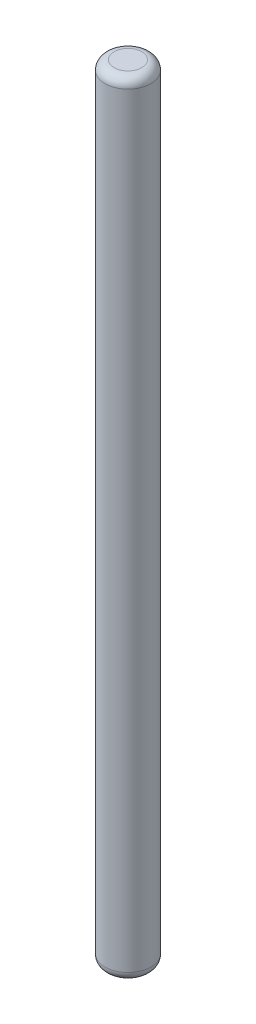
ISO-10303-21;
HEADER;
FILE_DESCRIPTION(('STEP AP214'),'2;1');
FILE_NAME('part.step','',(''),(''),'','','');
FILE_SCHEMA(('AUTOMOTIVE_DESIGN { 1 0 10303 214 1 1 1 1 }'));
ENDSEC;
DATA;
#1=APPLICATION_CONTEXT('core data for automotive mechanical design processes');
#2=APPLICATION_PROTOCOL_DEFINITION('international standard','automotive_design',2000,#1);
#3=PRODUCT_CONTEXT('',#1,'mechanical');
#4=PRODUCT('Part','Part','',(#3));
#5=PRODUCT_RELATED_PRODUCT_CATEGORY('part','',(#4));
#6=PRODUCT_DEFINITION_FORMATION('','',#4);
#7=PRODUCT_DEFINITION_CONTEXT('part definition',#1,'design');
#8=PRODUCT_DEFINITION('design','',#6,#7);
#9=PRODUCT_DEFINITION_SHAPE('','',#8);
#10=(LENGTH_UNIT() NAMED_UNIT(*) SI_UNIT(.MILLI.,.METRE.));
#11=(NAMED_UNIT(*) PLANE_ANGLE_UNIT() SI_UNIT($,.RADIAN.));
#12=(NAMED_UNIT(*) SI_UNIT($,.STERADIAN.) SOLID_ANGLE_UNIT());
#13=UNCERTAINTY_MEASURE_WITH_UNIT(LENGTH_MEASURE(1.E-05),#10,'distance_accuracy_value','');
#14=(GEOMETRIC_REPRESENTATION_CONTEXT(3) GLOBAL_UNCERTAINTY_ASSIGNED_CONTEXT((#13)) GLOBAL_UNIT_ASSIGNED_CONTEXT((#10,
#11,#12)) REPRESENTATION_CONTEXT('',''));
#15=CARTESIAN_POINT('',(0.,0.,0.));
#16=DIRECTION('',(0.,0.,1.));
#17=DIRECTION('',(1.,0.,0.));
#18=AXIS2_PLACEMENT_3D('',#15,#16,#17);
#19=CARTESIAN_POINT('',(0.0610619421206054,85.,-0.0610619421206095));
#20=DIRECTION('',(0.,-1.,0.));
#21=DIRECTION('',(0.,0.,-1.));
#22=AXIS2_PLACEMENT_3D('',#19,#20,#21);
#23=CYLINDRICAL_SURFACE('',#22,2.5);
#24=CARTESIAN_POINT('',(0.0610619421206054,1.,-0.0610619421206095));
#25=DIRECTION('',(0.,1.,0.));
#26=DIRECTION('',(0.,0.,1.));
#27=AXIS2_PLACEMENT_3D('',#24,#25,#26);
#28=CIRCLE('',#27,2.5);
#29=CARTESIAN_POINT('',(0.0610619421206054,1.,2.43893805787939));
#30=VERTEX_POINT('',#29);
#31=EDGE_CURVE('E41',#30,#30,#28,.T.);
#32=ORIENTED_EDGE('',*,*,#31,.T.);
#33=EDGE_LOOP('',(#32));
#34=FACE_BOUND('',#33,.T.);
#35=DIRECTION('',(0.,1.,0.));
#36=VECTOR('',#35,1.);
#37=CARTESIAN_POINT('',(1.1730828056927,60.,-2.30012638937986));
#38=LINE('',#37,#36);
#39=CARTESIAN_POINT('',(1.1730828056927,60.,-2.30012638937986));
#40=VERTEX_POINT('',#39);
#41=CARTESIAN_POINT('',(1.1730828056927,84.,-2.30012638937986));
#42=VERTEX_POINT('',#41);
#43=EDGE_CURVE('E73',#40,#42,#38,.T.);
#44=ORIENTED_EDGE('',*,*,#43,.T.);
#45=CARTESIAN_POINT('',(0.0610619421206054,84.,-0.0610619421206095));
#46=DIRECTION('',(0.,1.,0.));
#47=DIRECTION('',(0.,0.,1.));
#48=AXIS2_PLACEMENT_3D('',#45,#46,#47);
#49=CIRCLE('',#48,2.5);
#50=CARTESIAN_POINT('',(-1.0062591401267,84.,-2.32177548155687));
#51=VERTEX_POINT('',#50);
#52=EDGE_CURVE('E77',#42,#51,#49,.F.);
#53=ORIENTED_EDGE('',*,*,#52,.T.);
#54=DIRECTION('',(0.,1.,0.));
#55=VECTOR('',#54,1.);
#56=CARTESIAN_POINT('',(-1.0062591401267,60.,-2.32177548155687));
#57=LINE('',#56,#55);
#58=CARTESIAN_POINT('',(-1.0062591401267,60.,-2.32177548155687));
#59=VERTEX_POINT('',#58);
#60=EDGE_CURVE('E72',#59,#51,#57,.T.);
#61=ORIENTED_EDGE('',*,*,#60,.F.);
#62=CARTESIAN_POINT('',(0.0610619421206054,60.,-0.0610619421206095));
#63=DIRECTION('',(0.,1.,0.));
#64=DIRECTION('',(0.,0.,1.));
#65=AXIS2_PLACEMENT_3D('',#62,#63,#64);
#66=CIRCLE('',#65,2.5);
#67=EDGE_CURVE('E64',#40,#59,#66,.T.);
#68=ORIENTED_EDGE('',*,*,#67,.F.);
#69=EDGE_LOOP('',(#44,#53,#61,#68));
#70=FACE_BOUND('',#69,.T.);
#71=ADVANCED_FACE('F33',(#34,#70),#23,.T.);
#72=CARTESIAN_POINT('',(0.0610619421206054,85.,-0.0610619421206095));
#73=DIRECTION('',(0.,1.,0.));
#74=DIRECTION('',(0.,0.,1.));
#75=AXIS2_PLACEMENT_3D('',#72,#73,#74);
#76=PLANE('',#75);
#77=CARTESIAN_POINT('',(0.0610619421206054,85.,-0.0610619421206095));
#78=DIRECTION('',(0.,1.,0.));
#79=DIRECTION('',(0.,0.,1.));
#80=AXIS2_PLACEMENT_3D('',#77,#78,#79);
#81=CIRCLE('',#80,1.5);
#82=CARTESIAN_POINT('',(-0.57933070722778,85.,-1.41749006578237));
#83=VERTEX_POINT('',#82);
#84=EDGE_CURVE('E46',#83,#83,#81,.T.);
#85=ORIENTED_EDGE('',*,*,#84,.T.);
#86=EDGE_LOOP('',(#85));
#87=FACE_BOUND('',#86,.T.);
#88=ADVANCED_FACE('F96',(#87),#76,.T.);
#89=CARTESIAN_POINT('',(0.0610619421206054,0.,-0.0610619421206095));
#90=DIRECTION('',(0.,1.,0.));
#91=DIRECTION('',(0.,0.,1.));
#92=AXIS2_PLACEMENT_3D('',#89,#90,#91);
#93=PLANE('',#92);
#94=CARTESIAN_POINT('',(0.0610619421206054,0.,-0.0610619421206095));
#95=DIRECTION('',(0.,1.,0.));
#96=DIRECTION('',(0.,0.,1.));
#97=AXIS2_PLACEMENT_3D('',#94,#95,#96);
#98=CIRCLE('',#97,1.5);
#99=CARTESIAN_POINT('',(0.0610619421206054,0.,1.43893805787939));
#100=VERTEX_POINT('',#99);
#101=EDGE_CURVE('E11',#100,#100,#98,.F.);
#102=ORIENTED_EDGE('',*,*,#101,.T.);
#103=EDGE_LOOP('',(#102));
#104=FACE_BOUND('',#103,.T.);
#105=ADVANCED_FACE('F95',(#104),#93,.F.);
#106=CARTESIAN_POINT('',(-1.0062591401267,60.,-2.32177548155687));
#107=DIRECTION('',(-0.00993328473884208,0.,0.999950663710114));
#108=DIRECTION('',(0.999950663710114,0.,0.00993328473884209));
#109=AXIS2_PLACEMENT_3D('',#106,#107,#108);
#110=PLANE('',#109);
#111=ORIENTED_EDGE('',*,*,#60,.T.);
#112=CARTESIAN_POINT('',(-1.0062591401267,84.,-2.32177548155687));
#113=CARTESIAN_POINT('',(-1.00631033317868,84.0257499887344,-2.32177599009712));
#114=CARTESIAN_POINT('',(-1.0039810217002,84.0514506104348,-2.32175285124138));
#115=CARTESIAN_POINT('',(-0.994995752809504,84.1019040028832,-2.32166359360339));
#116=CARTESIAN_POINT('',(-0.988370552567407,84.1266621971751,-2.32159778035595));
#117=CARTESIAN_POINT('',(-0.97123444522594,84.1747163457058,-2.32142755412408));
#118=CARTESIAN_POINT('',(-0.960731452519259,84.1980151659547,-2.32132321975945));
#119=CARTESIAN_POINT('',(-0.93643118514888,84.2428520651656,-2.32108182637497));
#120=CARTESIAN_POINT('',(-0.922627961103178,84.2643868688766,-2.32094470825531));
#121=CARTESIAN_POINT('',(-0.885025735099742,84.315375503014,-2.32057117620892));
#122=CARTESIAN_POINT('',(-0.859615862734575,84.3436421887853,-2.32031876025828));
#123=CARTESIAN_POINT('',(-0.804620181817592,84.3957555623736,-2.31977244554718));
#124=CARTESIAN_POINT('',(-0.775025339542913,84.4195924233207,-2.31947845704776));
#125=CARTESIAN_POINT('',(-0.697051615138196,84.4743140168869,-2.31870388362652));
#126=CARTESIAN_POINT('',(-0.646822331847803,84.5025451452475,-2.31820491723622));
#127=CARTESIAN_POINT('',(-0.542704753328837,84.5510427446244,-2.31717063665491));
#128=CARTESIAN_POINT('',(-0.488809590600881,84.5712937556895,-2.3166352542437));
#129=CARTESIAN_POINT('',(-0.388965050704052,84.6020510013919,-2.31564342106592));
#130=CARTESIAN_POINT('',(-0.343344354841181,84.6136578492241,-2.31519023534543));
#131=CARTESIAN_POINT('',(-0.251258477705556,84.6329359116967,-2.31427547497653));
#132=CARTESIAN_POINT('',(-0.204792751425287,84.6406044858595,-2.31381389491414));
#133=CARTESIAN_POINT('',(-0.111260526632352,84.6523858278835,-2.31288476685329));
#134=CARTESIAN_POINT('',(-0.0641925183746456,84.6564863632128,-2.31241720385735));
#135=CARTESIAN_POINT('',(0.0301176718546658,84.6612889872444,-2.31148034766302));
#136=CARTESIAN_POINT('',(0.0773598700386019,84.6619907511926,-2.31101105430357));
#137=CARTESIAN_POINT('',(0.174380010781724,84.6599767382401,-2.31004727807103));
#138=CARTESIAN_POINT('',(0.224154175603773,84.6570704334021,-2.30955283272511));
#139=CARTESIAN_POINT('',(0.323352322361662,84.647351465898,-2.30856742067123));
#140=CARTESIAN_POINT('',(0.372776118911912,84.640536871771,-2.30807645580483));
#141=CARTESIAN_POINT('',(0.47057786253572,84.622679375656,-2.30710491530526));
#142=CARTESIAN_POINT('',(0.518960158491438,84.6116607368836,-2.30662429647126));
#143=CARTESIAN_POINT('',(0.614344556207763,84.5848282251451,-2.30567676934163));
#144=CARTESIAN_POINT('',(0.661348379537118,84.5690206395421,-2.30520984394432));
#145=CARTESIAN_POINT('',(0.746297075132156,84.5345904604404,-2.3043659827298));
#146=CARTESIAN_POINT('',(0.784549503808907,84.5167362593022,-2.30398599171645));
#147=CARTESIAN_POINT('',(0.858625892417835,84.4763674909329,-2.30325013355146));
#148=CARTESIAN_POINT('',(0.894446849196684,84.4538472948651,-2.30289429623247));
#149=CARTESIAN_POINT('',(0.962749795088704,84.4032426767613,-2.30221579014745));
#150=CARTESIAN_POINT('',(0.995180467613994,84.3750875735631,-2.30189363114885));
#151=CARTESIAN_POINT('',(1.05402687609467,84.3130730117989,-2.30130906417719));
#152=CARTESIAN_POINT('',(1.0804648667686,84.2792354991597,-2.30104643513076));
#153=CARTESIAN_POINT('',(1.11641536563521,84.2199676123323,-2.30068931096983));
#154=CARTESIAN_POINT('',(1.12855950645761,84.1961287340362,-2.30056867380935));
#155=CARTESIAN_POINT('',(1.14877396415882,84.1467957088242,-2.30036786793814));
#156=CARTESIAN_POINT('',(1.15685102246279,84.1213043806518,-2.30028763225963));
#157=CARTESIAN_POINT('',(1.16836614027504,84.0692250321703,-2.30017324367209));
#158=CARTESIAN_POINT('',(1.17179449404148,84.0426348364313,-2.30013918717772));
#159=CARTESIAN_POINT('',(1.17379424305161,83.9890823158577,-2.30011932212133));
#160=CARTESIAN_POINT('',(1.17232996673068,83.9621186915818,-2.30013386791259));
#161=CARTESIAN_POINT('',(1.1682988411613,83.9355095828083,-2.30017391220633));
#162=B_SPLINE_CURVE_WITH_KNOTS('',3,(#112,#113,#114,#115,#116,#117,#118,#119,#120,#121,#122,
#123,#124,#125,#126,#127,#128,#129,#130,#131,#132,#133,#134,#135,#136,#137,#138,#139,#140,#141,
#142,#143,#144,#145,#146,#147,#148,#149,#150,#151,#152,#153,#154,#155,#156,#157,#158,#159,#160,
#161),.UNSPECIFIED.,.F.,.F.,(4,2,2,2,2,2,2,2,2,2,2,2,2,2,2,2,2,2,2,2,2,2,2,2,4),(0.,
0.0770663904628506,0.153587013760128,0.229952317676831,0.306456338587907,0.419841634800272,
0.533475531886061,0.705377758784609,0.877611395112667,1.01865274467184,1.15978853457695,
1.30140630401216,1.44303760481443,1.59247647297903,1.74198925694611,1.89065188562409,
2.03912017620549,2.16550593351644,2.29204505376111,2.42028398886925,2.54803858884939,
2.62799249478937,2.70781343259864,2.78780076830566,2.86837255062909),.UNSPECIFIED.);
#163=EDGE_CURVE('E53',#51,#42,#162,.T.);
#164=ORIENTED_EDGE('',*,*,#163,.T.);
#165=ORIENTED_EDGE('',*,*,#43,.F.);
#166=DIRECTION('',(0.999950663710114,0.,0.00993328473884209));
#167=VECTOR('',#166,1.);
#168=CARTESIAN_POINT('',(-1.0062591401267,60.,-2.32177548155687));
#169=LINE('',#168,#167);
#170=EDGE_CURVE('E67',#59,#40,#169,.T.);
#171=ORIENTED_EDGE('',*,*,#170,.F.);
#172=EDGE_LOOP('',(#111,#164,#165,#171));
#173=FACE_BOUND('',#172,.T.);
#174=ADVANCED_FACE('F71',(#173),#110,.F.);
#175=CARTESIAN_POINT('',(0.0610619421206054,60.,-0.0610619421206095));
#176=DIRECTION('',(0.,1.,0.));
#177=DIRECTION('',(0.,0.,1.));
#178=AXIS2_PLACEMENT_3D('',#175,#176,#177);
#179=PLANE('',#178);
#180=ORIENTED_EDGE('',*,*,#67,.T.);
#181=ORIENTED_EDGE('',*,*,#170,.T.);
#182=EDGE_LOOP('',(#180,#181));
#183=FACE_BOUND('',#182,.T.);
#184=ADVANCED_FACE('F66',(#183),#179,.T.);
#185=CARTESIAN_POINT('',(0.0610619421206054,84.,-0.0610619421206095));
#186=DIRECTION('',(0.,1.,0.));
#187=DIRECTION('',(0.,0.,1.));
#188=AXIS2_PLACEMENT_3D('',#185,#186,#187);
#189=TOROIDAL_SURFACE('',#188,1.5,1.);
#190=ORIENTED_EDGE('',*,*,#163,.F.);
#191=ORIENTED_EDGE('',*,*,#52,.F.);
#192=EDGE_LOOP('',(#190,#191));
#193=FACE_BOUND('',#192,.T.);
#194=ORIENTED_EDGE('',*,*,#84,.F.);
#195=EDGE_LOOP('',(#194));
#196=FACE_BOUND('',#195,.T.);
#197=ADVANCED_FACE('F88',(#193,#196),#189,.T.);
#198=CARTESIAN_POINT('',(0.0610619421206054,1.,-0.0610619421206095));
#199=DIRECTION('',(0.,1.,0.));
#200=DIRECTION('',(0.,0.,1.));
#201=AXIS2_PLACEMENT_3D('',#198,#199,#200);
#202=TOROIDAL_SURFACE('',#201,1.5,1.);
#203=ORIENTED_EDGE('',*,*,#101,.F.);
#204=EDGE_LOOP('',(#203));
#205=FACE_BOUND('',#204,.T.);
#206=ORIENTED_EDGE('',*,*,#31,.F.);
#207=EDGE_LOOP('',(#206));
#208=FACE_BOUND('',#207,.T.);
#209=ADVANCED_FACE('F35',(#205,#208),#202,.T.);
#210=CLOSED_SHELL('',(#71,#88,#105,#174,#184,#197,#209));
#211=MANIFOLD_SOLID_BREP('B2',#210);
#212=ADVANCED_BREP_SHAPE_REPRESENTATION('',(#18,#211),#14);
#213=SHAPE_DEFINITION_REPRESENTATION(#9,#212);
ENDSEC;
END-ISO-10303-21;
